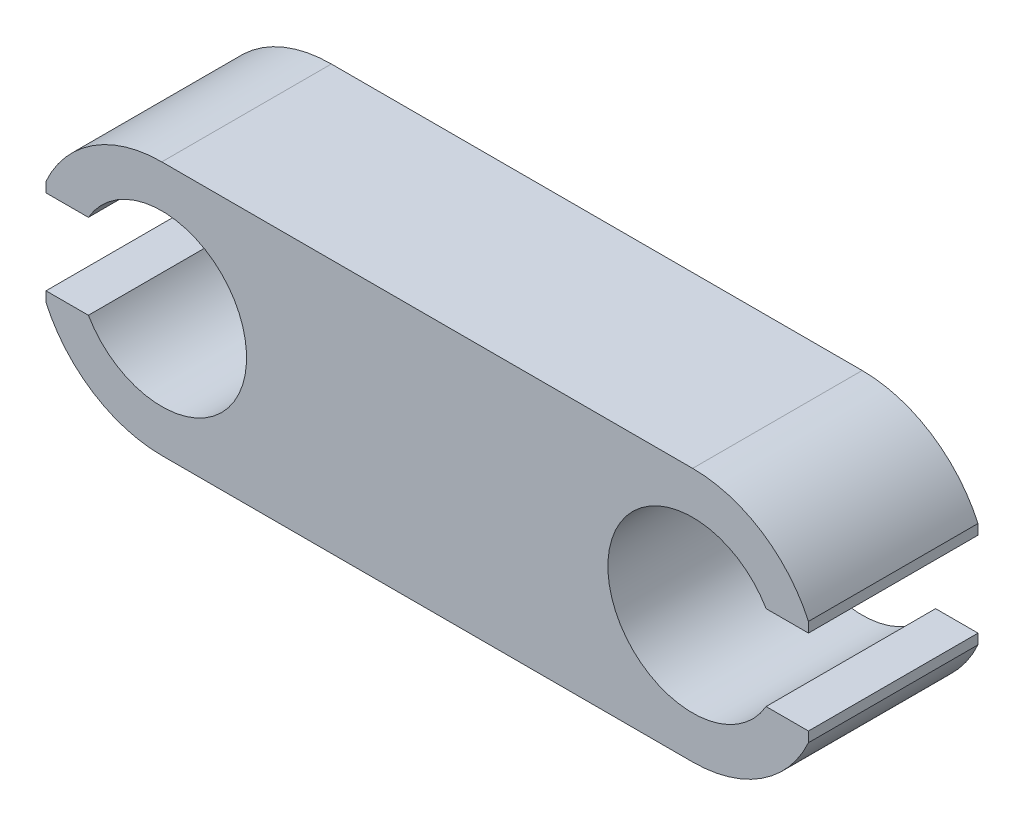
ISO-10303-21;
HEADER;
FILE_DESCRIPTION(('STEP AP214'),'2;1');
FILE_NAME('part.step','',(''),(''),'','','');
FILE_SCHEMA(('AUTOMOTIVE_DESIGN { 1 0 10303 214 1 1 1 1 }'));
ENDSEC;
DATA;
#1=APPLICATION_CONTEXT('core data for automotive mechanical design processes');
#2=APPLICATION_PROTOCOL_DEFINITION('international standard','automotive_design',2000,#1);
#3=PRODUCT_CONTEXT('',#1,'mechanical');
#4=PRODUCT('Part','Part','',(#3));
#5=PRODUCT_RELATED_PRODUCT_CATEGORY('part','',(#4));
#6=PRODUCT_DEFINITION_FORMATION('','',#4);
#7=PRODUCT_DEFINITION_CONTEXT('part definition',#1,'design');
#8=PRODUCT_DEFINITION('design','',#6,#7);
#9=PRODUCT_DEFINITION_SHAPE('','',#8);
#10=(LENGTH_UNIT() NAMED_UNIT(*) SI_UNIT(.MILLI.,.METRE.));
#11=(NAMED_UNIT(*) PLANE_ANGLE_UNIT() SI_UNIT($,.RADIAN.));
#12=(NAMED_UNIT(*) SI_UNIT($,.STERADIAN.) SOLID_ANGLE_UNIT());
#13=UNCERTAINTY_MEASURE_WITH_UNIT(LENGTH_MEASURE(1.E-05),#10,'distance_accuracy_value','');
#14=(GEOMETRIC_REPRESENTATION_CONTEXT(3) GLOBAL_UNCERTAINTY_ASSIGNED_CONTEXT((#13)) GLOBAL_UNIT_ASSIGNED_CONTEXT((#10,
#11,#12)) REPRESENTATION_CONTEXT('',''));
#15=CARTESIAN_POINT('',(0.,0.,0.));
#16=DIRECTION('',(0.,0.,1.));
#17=DIRECTION('',(1.,0.,0.));
#18=AXIS2_PLACEMENT_3D('',#15,#16,#17);
#19=CARTESIAN_POINT('',(-3.13109105,0.,2.));
#20=DIRECTION('',(0.,0.,-1.));
#21=DIRECTION('',(-1.,0.,0.));
#22=AXIS2_PLACEMENT_3D('',#19,#20,#21);
#23=CYLINDRICAL_SURFACE('',#22,1.5);
#24=CARTESIAN_POINT('',(-3.13109105,0.,2.));
#25=DIRECTION('',(0.,0.,1.));
#26=DIRECTION('',(1.,0.,0.));
#27=AXIS2_PLACEMENT_3D('',#24,#25,#26);
#28=CIRCLE('',#27,1.5);
#29=CARTESIAN_POINT('',(-4.49711645378444,-0.619656837463739,2.));
#30=VERTEX_POINT('',#29);
#31=CARTESIAN_POINT('',(-3.13109105,-1.5,2.));
#32=VERTEX_POINT('',#31);
#33=EDGE_CURVE('E218',#30,#32,#28,.T.);
#34=ORIENTED_EDGE('',*,*,#33,.F.);
#35=DIRECTION('',(0.,0.,1.));
#36=VECTOR('',#35,1.);
#37=CARTESIAN_POINT('',(-4.49711645378444,-0.619656837463739,-1.));
#38=LINE('',#37,#36);
#39=CARTESIAN_POINT('',(-4.49711645378444,-0.619656837463739,0.));
#40=VERTEX_POINT('',#39);
#41=EDGE_CURVE('E197',#40,#30,#38,.T.);
#42=ORIENTED_EDGE('',*,*,#41,.F.);
#43=CARTESIAN_POINT('',(-3.13109105,0.,0.));
#44=DIRECTION('',(0.,0.,1.));
#45=DIRECTION('',(1.,0.,0.));
#46=AXIS2_PLACEMENT_3D('',#43,#44,#45);
#47=CIRCLE('',#46,1.5);
#48=CARTESIAN_POINT('',(-3.13109105,-1.5,0.));
#49=VERTEX_POINT('',#48);
#50=EDGE_CURVE('E181',#40,#49,#47,.T.);
#51=ORIENTED_EDGE('',*,*,#50,.T.);
#52=DIRECTION('',(0.,0.,-1.));
#53=VECTOR('',#52,1.);
#54=CARTESIAN_POINT('',(-3.13109105,-1.5,2.));
#55=LINE('',#54,#53);
#56=EDGE_CURVE('E248',#32,#49,#55,.T.);
#57=ORIENTED_EDGE('',*,*,#56,.F.);
#58=EDGE_LOOP('',(#34,#42,#51,#57));
#59=FACE_BOUND('',#58,.T.);
#60=ADVANCED_FACE('F36',(#59),#23,.T.);
#61=CARTESIAN_POINT('',(3.13109105,0.,2.));
#62=DIRECTION('',(0.,0.,-1.));
#63=DIRECTION('',(-1.,0.,0.));
#64=AXIS2_PLACEMENT_3D('',#61,#62,#63);
#65=CYLINDRICAL_SURFACE('',#64,1.5);
#66=DIRECTION('',(0.,0.,1.));
#67=VECTOR('',#66,1.);
#68=CARTESIAN_POINT('',(4.49711645378443,0.619656837463739,-1.));
#69=LINE('',#68,#67);
#70=CARTESIAN_POINT('',(4.49711645378443,0.619656837463739,0.));
#71=VERTEX_POINT('',#70);
#72=CARTESIAN_POINT('',(4.49711645378443,0.619656837463739,2.));
#73=VERTEX_POINT('',#72);
#74=EDGE_CURVE('E184',#71,#73,#69,.T.);
#75=ORIENTED_EDGE('',*,*,#74,.F.);
#76=CARTESIAN_POINT('',(3.13109105,0.,0.));
#77=DIRECTION('',(0.,0.,1.));
#78=DIRECTION('',(1.,0.,0.));
#79=AXIS2_PLACEMENT_3D('',#76,#77,#78);
#80=CIRCLE('',#79,1.5);
#81=CARTESIAN_POINT('',(3.13109105,1.5,0.));
#82=VERTEX_POINT('',#81);
#83=EDGE_CURVE('E236',#82,#71,#80,.F.);
#84=ORIENTED_EDGE('',*,*,#83,.F.);
#85=DIRECTION('',(0.,0.,-1.));
#86=VECTOR('',#85,1.);
#87=CARTESIAN_POINT('',(3.13109105,1.5,2.));
#88=LINE('',#87,#86);
#89=CARTESIAN_POINT('',(3.13109105,1.5,2.));
#90=VERTEX_POINT('',#89);
#91=EDGE_CURVE('E243',#90,#82,#88,.T.);
#92=ORIENTED_EDGE('',*,*,#91,.F.);
#93=CARTESIAN_POINT('',(3.13109105,0.,2.));
#94=DIRECTION('',(0.,0.,1.));
#95=DIRECTION('',(1.,0.,0.));
#96=AXIS2_PLACEMENT_3D('',#93,#94,#95);
#97=CIRCLE('',#96,1.5);
#98=EDGE_CURVE('E222',#90,#73,#97,.F.);
#99=ORIENTED_EDGE('',*,*,#98,.T.);
#100=EDGE_LOOP('',(#75,#84,#92,#99));
#101=FACE_BOUND('',#100,.T.);
#102=ADVANCED_FACE('F283',(#101),#65,.T.);
#103=CARTESIAN_POINT('',(-3.13109105,1.5,0.));
#104=VERTEX_POINT('',#103);
#105=CARTESIAN_POINT('',(-4.49711645378444,0.619656837463739,0.));
#106=VERTEX_POINT('',#105);
#107=EDGE_CURVE('E229',#104,#106,#47,.T.);
#108=ORIENTED_EDGE('',*,*,#107,.T.);
#109=DIRECTION('',(0.,0.,1.));
#110=VECTOR('',#109,1.);
#111=CARTESIAN_POINT('',(-4.49711645378444,0.619656837463739,-1.));
#112=LINE('',#111,#110);
#113=CARTESIAN_POINT('',(-4.49711645378444,0.619656837463739,2.));
#114=VERTEX_POINT('',#113);
#115=EDGE_CURVE('E194',#106,#114,#112,.T.);
#116=ORIENTED_EDGE('',*,*,#115,.T.);
#117=CARTESIAN_POINT('',(-3.13109105,1.5,2.));
#118=VERTEX_POINT('',#117);
#119=EDGE_CURVE('E214',#118,#114,#28,.T.);
#120=ORIENTED_EDGE('',*,*,#119,.F.);
#121=DIRECTION('',(0.,0.,-1.));
#122=VECTOR('',#121,1.);
#123=CARTESIAN_POINT('',(-3.13109105,1.5,2.));
#124=LINE('',#123,#122);
#125=EDGE_CURVE('E228',#118,#104,#124,.T.);
#126=ORIENTED_EDGE('',*,*,#125,.T.);
#127=EDGE_LOOP('',(#108,#116,#120,#126));
#128=FACE_BOUND('',#127,.T.);
#129=ADVANCED_FACE('F38',(#128),#23,.T.);
#130=CARTESIAN_POINT('',(0.,-1.5,2.));
#131=DIRECTION('',(0.,1.,0.));
#132=DIRECTION('',(0.,0.,1.));
#133=AXIS2_PLACEMENT_3D('',#130,#131,#132);
#134=PLANE('',#133);
#135=DIRECTION('',(1.,0.,0.));
#136=VECTOR('',#135,1.);
#137=CARTESIAN_POINT('',(0.,-1.5,0.));
#138=LINE('',#137,#136);
#139=CARTESIAN_POINT('',(3.13109105,-1.5,0.));
#140=VERTEX_POINT('',#139);
#141=EDGE_CURVE('E232',#49,#140,#138,.T.);
#142=ORIENTED_EDGE('',*,*,#141,.T.);
#143=DIRECTION('',(0.,0.,-1.));
#144=VECTOR('',#143,1.);
#145=CARTESIAN_POINT('',(3.13109105,-1.5,2.));
#146=LINE('',#145,#144);
#147=CARTESIAN_POINT('',(3.13109105,-1.5,2.));
#148=VERTEX_POINT('',#147);
#149=EDGE_CURVE('E245',#148,#140,#146,.T.);
#150=ORIENTED_EDGE('',*,*,#149,.F.);
#151=DIRECTION('',(1.,0.,0.));
#152=VECTOR('',#151,1.);
#153=CARTESIAN_POINT('',(0.,-1.5,2.));
#154=LINE('',#153,#152);
#155=EDGE_CURVE('E217',#32,#148,#154,.T.);
#156=ORIENTED_EDGE('',*,*,#155,.F.);
#157=ORIENTED_EDGE('',*,*,#56,.T.);
#158=EDGE_LOOP('',(#142,#150,#156,#157));
#159=FACE_BOUND('',#158,.T.);
#160=ADVANCED_FACE('F318',(#159),#134,.F.);
#161=DIRECTION('',(0.,0.,1.));
#162=VECTOR('',#161,1.);
#163=CARTESIAN_POINT('',(4.49711645378444,-0.619656837463737,-1.));
#164=LINE('',#163,#162);
#165=CARTESIAN_POINT('',(4.49711645378444,-0.619656837463737,0.));
#166=VERTEX_POINT('',#165);
#167=CARTESIAN_POINT('',(4.49711645378444,-0.619656837463737,2.));
#168=VERTEX_POINT('',#167);
#169=EDGE_CURVE('E186',#166,#168,#164,.T.);
#170=ORIENTED_EDGE('',*,*,#169,.T.);
#171=EDGE_CURVE('E221',#168,#148,#97,.F.);
#172=ORIENTED_EDGE('',*,*,#171,.T.);
#173=ORIENTED_EDGE('',*,*,#149,.T.);
#174=EDGE_CURVE('E235',#166,#140,#80,.F.);
#175=ORIENTED_EDGE('',*,*,#174,.F.);
#176=EDGE_LOOP('',(#170,#172,#173,#175));
#177=FACE_BOUND('',#176,.T.);
#178=ADVANCED_FACE('F320',(#177),#65,.T.);
#179=CARTESIAN_POINT('',(0.,1.5,2.));
#180=DIRECTION('',(0.,1.,0.));
#181=DIRECTION('',(0.,0.,1.));
#182=AXIS2_PLACEMENT_3D('',#179,#180,#181);
#183=PLANE('',#182);
#184=DIRECTION('',(1.,0.,0.));
#185=VECTOR('',#184,1.);
#186=CARTESIAN_POINT('',(0.,1.5,0.));
#187=LINE('',#186,#185);
#188=EDGE_CURVE('E239',#104,#82,#187,.T.);
#189=ORIENTED_EDGE('',*,*,#188,.F.);
#190=ORIENTED_EDGE('',*,*,#125,.F.);
#191=DIRECTION('',(1.,0.,0.));
#192=VECTOR('',#191,1.);
#193=CARTESIAN_POINT('',(0.,1.5,2.));
#194=LINE('',#193,#192);
#195=EDGE_CURVE('E225',#118,#90,#194,.T.);
#196=ORIENTED_EDGE('',*,*,#195,.T.);
#197=ORIENTED_EDGE('',*,*,#91,.T.);
#198=EDGE_LOOP('',(#189,#190,#196,#197));
#199=FACE_BOUND('',#198,.T.);
#200=ADVANCED_FACE('F287',(#199),#183,.T.);
#201=CARTESIAN_POINT('',(0.,0.,2.));
#202=DIRECTION('',(0.,0.,1.));
#203=DIRECTION('',(1.,0.,0.));
#204=AXIS2_PLACEMENT_3D('',#201,#202,#203);
#205=PLANE('',#204);
#206=DIRECTION('',(0.,-1.,0.));
#207=VECTOR('',#206,1.);
#208=CARTESIAN_POINT('',(4.49711645378443,0.5,2.));
#209=LINE('',#208,#207);
#210=CARTESIAN_POINT('',(4.49711645378443,0.5,2.));
#211=VERTEX_POINT('',#210);
#212=EDGE_CURVE('E174',#73,#211,#209,.T.);
#213=ORIENTED_EDGE('',*,*,#212,.F.);
#214=ORIENTED_EDGE('',*,*,#98,.F.);
#215=ORIENTED_EDGE('',*,*,#195,.F.);
#216=ORIENTED_EDGE('',*,*,#119,.T.);
#217=DIRECTION('',(0.,1.,0.));
#218=VECTOR('',#217,1.);
#219=CARTESIAN_POINT('',(-4.49711645378444,0.5,2.));
#220=LINE('',#219,#218);
#221=CARTESIAN_POINT('',(-4.49711645378444,0.5,2.));
#222=VERTEX_POINT('',#221);
#223=EDGE_CURVE('E208',#222,#114,#220,.T.);
#224=ORIENTED_EDGE('',*,*,#223,.F.);
#225=DIRECTION('',(-1.,0.,0.));
#226=VECTOR('',#225,1.);
#227=CARTESIAN_POINT('',(-3.99711645378444,0.5,2.));
#228=LINE('',#227,#226);
#229=CARTESIAN_POINT('',(-3.99711645378444,0.5,2.));
#230=VERTEX_POINT('',#229);
#231=EDGE_CURVE('E210',#230,#222,#228,.T.);
#232=ORIENTED_EDGE('',*,*,#231,.F.);
#233=CARTESIAN_POINT('',(-3.13109105,0.,2.));
#234=DIRECTION('',(0.,0.,1.));
#235=DIRECTION('',(1.,0.,0.));
#236=AXIS2_PLACEMENT_3D('',#233,#234,#235);
#237=CIRCLE('',#236,1.);
#238=CARTESIAN_POINT('',(-3.99711645378444,-0.5,2.));
#239=VERTEX_POINT('',#238);
#240=EDGE_CURVE('E167',#239,#230,#237,.T.);
#241=ORIENTED_EDGE('',*,*,#240,.F.);
#242=DIRECTION('',(1.,0.,0.));
#243=VECTOR('',#242,1.);
#244=CARTESIAN_POINT('',(-3.99711645378444,-0.5,2.));
#245=LINE('',#244,#243);
#246=CARTESIAN_POINT('',(-4.49711645378444,-0.5,2.));
#247=VERTEX_POINT('',#246);
#248=EDGE_CURVE('E192',#247,#239,#245,.T.);
#249=ORIENTED_EDGE('',*,*,#248,.F.);
#250=DIRECTION('',(0.,1.,0.));
#251=VECTOR('',#250,1.);
#252=CARTESIAN_POINT('',(-4.49711645378444,-0.5,2.));
#253=LINE('',#252,#251);
#254=EDGE_CURVE('E205',#30,#247,#253,.T.);
#255=ORIENTED_EDGE('',*,*,#254,.F.);
#256=ORIENTED_EDGE('',*,*,#33,.T.);
#257=ORIENTED_EDGE('',*,*,#155,.T.);
#258=ORIENTED_EDGE('',*,*,#171,.F.);
#259=DIRECTION('',(0.,-1.,0.));
#260=VECTOR('',#259,1.);
#261=CARTESIAN_POINT('',(4.49711645378444,-0.5,2.));
#262=LINE('',#261,#260);
#263=CARTESIAN_POINT('',(4.49711645378444,-0.5,2.));
#264=VERTEX_POINT('',#263);
#265=EDGE_CURVE('E172',#264,#168,#262,.T.);
#266=ORIENTED_EDGE('',*,*,#265,.F.);
#267=DIRECTION('',(1.,0.,0.));
#268=VECTOR('',#267,1.);
#269=CARTESIAN_POINT('',(3.99711645378444,-0.5,2.));
#270=LINE('',#269,#268);
#271=CARTESIAN_POINT('',(3.99711645378444,-0.5,2.));
#272=VERTEX_POINT('',#271);
#273=EDGE_CURVE('E151',#272,#264,#270,.T.);
#274=ORIENTED_EDGE('',*,*,#273,.F.);
#275=CARTESIAN_POINT('',(3.13109105,0.,2.));
#276=DIRECTION('',(0.,0.,1.));
#277=DIRECTION('',(-1.,0.,0.));
#278=AXIS2_PLACEMENT_3D('',#275,#276,#277);
#279=CIRCLE('',#278,1.);
#280=CARTESIAN_POINT('',(3.99711645378443,0.5,2.));
#281=VERTEX_POINT('',#280);
#282=EDGE_CURVE('E160',#281,#272,#279,.T.);
#283=ORIENTED_EDGE('',*,*,#282,.F.);
#284=DIRECTION('',(-1.,0.,0.));
#285=VECTOR('',#284,1.);
#286=CARTESIAN_POINT('',(3.99711645378443,0.5,2.));
#287=LINE('',#286,#285);
#288=EDGE_CURVE('E157',#211,#281,#287,.T.);
#289=ORIENTED_EDGE('',*,*,#288,.F.);
#290=EDGE_LOOP('',(#213,#214,#215,#216,#224,#232,#241,#249,#255,#256,#257,#258,#266,#274,#283,#289));
#291=FACE_BOUND('',#290,.T.);
#292=ADVANCED_FACE('F170',(#291),#205,.T.);
#293=CARTESIAN_POINT('',(0.,0.,0.));
#294=DIRECTION('',(0.,0.,1.));
#295=DIRECTION('',(1.,0.,0.));
#296=AXIS2_PLACEMENT_3D('',#293,#294,#295);
#297=PLANE('',#296);
#298=ORIENTED_EDGE('',*,*,#83,.T.);
#299=DIRECTION('',(0.,-1.,0.));
#300=VECTOR('',#299,1.);
#301=CARTESIAN_POINT('',(4.49711645378443,0.,0.));
#302=LINE('',#301,#300);
#303=CARTESIAN_POINT('',(4.49711645378443,0.5,0.));
#304=VERTEX_POINT('',#303);
#305=EDGE_CURVE('E11',#71,#304,#302,.T.);
#306=ORIENTED_EDGE('',*,*,#305,.T.);
#307=DIRECTION('',(-1.,0.,0.));
#308=VECTOR('',#307,1.);
#309=CARTESIAN_POINT('',(0.,0.500000000000001,0.));
#310=LINE('',#309,#308);
#311=CARTESIAN_POINT('',(3.99711645378443,0.5,0.));
#312=VERTEX_POINT('',#311);
#313=EDGE_CURVE('E44',#304,#312,#310,.T.);
#314=ORIENTED_EDGE('',*,*,#313,.T.);
#315=CARTESIAN_POINT('',(3.13109105,0.,0.));
#316=DIRECTION('',(0.,0.,1.));
#317=DIRECTION('',(1.,0.,0.));
#318=AXIS2_PLACEMENT_3D('',#315,#316,#317);
#319=CIRCLE('',#318,1.);
#320=CARTESIAN_POINT('',(3.99711645378444,-0.5,0.));
#321=VERTEX_POINT('',#320);
#322=EDGE_CURVE('E270',#312,#321,#319,.T.);
#323=ORIENTED_EDGE('',*,*,#322,.T.);
#324=DIRECTION('',(1.,0.,0.));
#325=VECTOR('',#324,1.);
#326=CARTESIAN_POINT('',(0.,-0.500000000000001,0.));
#327=LINE('',#326,#325);
#328=CARTESIAN_POINT('',(4.49711645378444,-0.5,0.));
#329=VERTEX_POINT('',#328);
#330=EDGE_CURVE('E154',#321,#329,#327,.T.);
#331=ORIENTED_EDGE('',*,*,#330,.T.);
#332=DIRECTION('',(0.,-1.,0.));
#333=VECTOR('',#332,1.);
#334=CARTESIAN_POINT('',(4.49711645378443,0.,0.));
#335=LINE('',#334,#333);
#336=EDGE_CURVE('E267',#329,#166,#335,.T.);
#337=ORIENTED_EDGE('',*,*,#336,.T.);
#338=ORIENTED_EDGE('',*,*,#174,.T.);
#339=ORIENTED_EDGE('',*,*,#141,.F.);
#340=ORIENTED_EDGE('',*,*,#50,.F.);
#341=DIRECTION('',(0.,1.,0.));
#342=VECTOR('',#341,1.);
#343=CARTESIAN_POINT('',(-4.49711645378444,0.,0.));
#344=LINE('',#343,#342);
#345=CARTESIAN_POINT('',(-4.49711645378444,-0.5,0.));
#346=VERTEX_POINT('',#345);
#347=EDGE_CURVE('E263',#40,#346,#344,.T.);
#348=ORIENTED_EDGE('',*,*,#347,.T.);
#349=DIRECTION('',(1.,0.,0.));
#350=VECTOR('',#349,1.);
#351=CARTESIAN_POINT('',(0.,-0.500000000000001,0.));
#352=LINE('',#351,#350);
#353=CARTESIAN_POINT('',(-3.99711645378444,-0.5,0.));
#354=VERTEX_POINT('',#353);
#355=EDGE_CURVE('E260',#346,#354,#352,.T.);
#356=ORIENTED_EDGE('',*,*,#355,.T.);
#357=CARTESIAN_POINT('',(-3.13109105,0.,0.));
#358=DIRECTION('',(0.,0.,1.));
#359=DIRECTION('',(1.,0.,0.));
#360=AXIS2_PLACEMENT_3D('',#357,#358,#359);
#361=CIRCLE('',#360,1.);
#362=CARTESIAN_POINT('',(-3.99711645378444,0.5,0.));
#363=VERTEX_POINT('',#362);
#364=EDGE_CURVE('E257',#354,#363,#361,.T.);
#365=ORIENTED_EDGE('',*,*,#364,.T.);
#366=DIRECTION('',(-1.,0.,0.));
#367=VECTOR('',#366,1.);
#368=CARTESIAN_POINT('',(0.,0.500000000000001,0.));
#369=LINE('',#368,#367);
#370=CARTESIAN_POINT('',(-4.49711645378444,0.5,0.));
#371=VERTEX_POINT('',#370);
#372=EDGE_CURVE('E251',#363,#371,#369,.T.);
#373=ORIENTED_EDGE('',*,*,#372,.T.);
#374=DIRECTION('',(0.,1.,0.));
#375=VECTOR('',#374,1.);
#376=CARTESIAN_POINT('',(-4.49711645378444,0.,0.));
#377=LINE('',#376,#375);
#378=EDGE_CURVE('E254',#371,#106,#377,.T.);
#379=ORIENTED_EDGE('',*,*,#378,.T.);
#380=ORIENTED_EDGE('',*,*,#107,.F.);
#381=ORIENTED_EDGE('',*,*,#188,.T.);
#382=EDGE_LOOP('',(#298,#306,#314,#323,#331,#337,#338,#339,#340,#348,#356,#365,#373,#379,#380,#381));
#383=FACE_BOUND('',#382,.T.);
#384=ADVANCED_FACE('F273',(#383),#297,.F.);
#385=CARTESIAN_POINT('',(-3.13109105,0.,-1.));
#386=DIRECTION('',(0.,0.,1.));
#387=DIRECTION('',(1.,0.,0.));
#388=AXIS2_PLACEMENT_3D('',#385,#386,#387);
#389=CYLINDRICAL_SURFACE('',#388,1.);
#390=DIRECTION('',(0.,0.,1.));
#391=VECTOR('',#390,1.);
#392=CARTESIAN_POINT('',(-3.99711645378444,-0.5,-1.));
#393=LINE('',#392,#391);
#394=EDGE_CURVE('E201',#354,#239,#393,.T.);
#395=ORIENTED_EDGE('',*,*,#394,.T.);
#396=ORIENTED_EDGE('',*,*,#240,.T.);
#397=DIRECTION('',(0.,0.,1.));
#398=VECTOR('',#397,1.);
#399=CARTESIAN_POINT('',(-3.99711645378444,0.5,-1.));
#400=LINE('',#399,#398);
#401=EDGE_CURVE('E190',#363,#230,#400,.T.);
#402=ORIENTED_EDGE('',*,*,#401,.F.);
#403=ORIENTED_EDGE('',*,*,#364,.F.);
#404=EDGE_LOOP('',(#395,#396,#402,#403));
#405=FACE_BOUND('',#404,.T.);
#406=ADVANCED_FACE('F298',(#405),#389,.F.);
#407=CARTESIAN_POINT('',(-3.99711645378444,-0.5,-1.));
#408=DIRECTION('',(0.,-1.,0.));
#409=DIRECTION('',(1.,0.,0.));
#410=AXIS2_PLACEMENT_3D('',#407,#408,#409);
#411=PLANE('',#410);
#412=DIRECTION('',(0.,0.,1.));
#413=VECTOR('',#412,1.);
#414=CARTESIAN_POINT('',(-4.49711645378444,-0.5,-1.));
#415=LINE('',#414,#413);
#416=EDGE_CURVE('E199',#346,#247,#415,.T.);
#417=ORIENTED_EDGE('',*,*,#416,.T.);
#418=ORIENTED_EDGE('',*,*,#248,.T.);
#419=ORIENTED_EDGE('',*,*,#394,.F.);
#420=ORIENTED_EDGE('',*,*,#355,.F.);
#421=EDGE_LOOP('',(#417,#418,#419,#420));
#422=FACE_BOUND('',#421,.T.);
#423=ADVANCED_FACE('F305',(#422),#411,.F.);
#424=CARTESIAN_POINT('',(-4.49711645378444,-0.5,-1.));
#425=DIRECTION('',(1.,0.,0.));
#426=DIRECTION('',(0.,0.,-1.));
#427=AXIS2_PLACEMENT_3D('',#424,#425,#426);
#428=PLANE('',#427);
#429=ORIENTED_EDGE('',*,*,#41,.T.);
#430=ORIENTED_EDGE('',*,*,#254,.T.);
#431=ORIENTED_EDGE('',*,*,#416,.F.);
#432=ORIENTED_EDGE('',*,*,#347,.F.);
#433=EDGE_LOOP('',(#429,#430,#431,#432));
#434=FACE_BOUND('',#433,.T.);
#435=ADVANCED_FACE('F308',(#434),#428,.F.);
#436=CARTESIAN_POINT('',(-4.49711645378444,0.5,-1.));
#437=DIRECTION('',(1.,0.,0.));
#438=DIRECTION('',(0.,0.,-1.));
#439=AXIS2_PLACEMENT_3D('',#436,#437,#438);
#440=PLANE('',#439);
#441=DIRECTION('',(0.,0.,1.));
#442=VECTOR('',#441,1.);
#443=CARTESIAN_POINT('',(-4.49711645378444,0.5,-1.));
#444=LINE('',#443,#442);
#445=EDGE_CURVE('E59',#371,#222,#444,.T.);
#446=ORIENTED_EDGE('',*,*,#445,.T.);
#447=ORIENTED_EDGE('',*,*,#223,.T.);
#448=ORIENTED_EDGE('',*,*,#115,.F.);
#449=ORIENTED_EDGE('',*,*,#378,.F.);
#450=EDGE_LOOP('',(#446,#447,#448,#449));
#451=FACE_BOUND('',#450,.T.);
#452=ADVANCED_FACE('F294',(#451),#440,.F.);
#453=CARTESIAN_POINT('',(-3.99711645378444,0.5,-1.));
#454=DIRECTION('',(0.,1.,0.));
#455=DIRECTION('',(-1.,0.,0.));
#456=AXIS2_PLACEMENT_3D('',#453,#454,#455);
#457=PLANE('',#456);
#458=ORIENTED_EDGE('',*,*,#401,.T.);
#459=ORIENTED_EDGE('',*,*,#231,.T.);
#460=ORIENTED_EDGE('',*,*,#445,.F.);
#461=ORIENTED_EDGE('',*,*,#372,.F.);
#462=EDGE_LOOP('',(#458,#459,#460,#461));
#463=FACE_BOUND('',#462,.T.);
#464=ADVANCED_FACE('F296',(#463),#457,.F.);
#465=CARTESIAN_POINT('',(3.13109105,0.,-1.));
#466=DIRECTION('',(0.,0.,1.));
#467=DIRECTION('',(1.,0.,0.));
#468=AXIS2_PLACEMENT_3D('',#465,#466,#467);
#469=CYLINDRICAL_SURFACE('',#468,1.);
#470=DIRECTION('',(0.,0.,1.));
#471=VECTOR('',#470,1.);
#472=CARTESIAN_POINT('',(3.99711645378443,0.5,-1.));
#473=LINE('',#472,#471);
#474=EDGE_CURVE('E163',#312,#281,#473,.T.);
#475=ORIENTED_EDGE('',*,*,#474,.T.);
#476=ORIENTED_EDGE('',*,*,#282,.T.);
#477=DIRECTION('',(0.,0.,1.));
#478=VECTOR('',#477,1.);
#479=CARTESIAN_POINT('',(3.99711645378444,-0.5,-1.));
#480=LINE('',#479,#478);
#481=EDGE_CURVE('E147',#321,#272,#480,.T.);
#482=ORIENTED_EDGE('',*,*,#481,.F.);
#483=ORIENTED_EDGE('',*,*,#322,.F.);
#484=EDGE_LOOP('',(#475,#476,#482,#483));
#485=FACE_BOUND('',#484,.T.);
#486=ADVANCED_FACE('F161',(#485),#469,.F.);
#487=CARTESIAN_POINT('',(3.99711645378443,0.5,-1.));
#488=DIRECTION('',(0.,1.,0.));
#489=DIRECTION('',(-1.,0.,0.));
#490=AXIS2_PLACEMENT_3D('',#487,#488,#489);
#491=PLANE('',#490);
#492=DIRECTION('',(0.,0.,1.));
#493=VECTOR('',#492,1.);
#494=CARTESIAN_POINT('',(4.49711645378443,0.5,-1.));
#495=LINE('',#494,#493);
#496=EDGE_CURVE('E182',#304,#211,#495,.T.);
#497=ORIENTED_EDGE('',*,*,#496,.T.);
#498=ORIENTED_EDGE('',*,*,#288,.T.);
#499=ORIENTED_EDGE('',*,*,#474,.F.);
#500=ORIENTED_EDGE('',*,*,#313,.F.);
#501=EDGE_LOOP('',(#497,#498,#499,#500));
#502=FACE_BOUND('',#501,.T.);
#503=ADVANCED_FACE('F276',(#502),#491,.F.);
#504=CARTESIAN_POINT('',(4.49711645378443,0.5,-1.));
#505=DIRECTION('',(-1.,0.,0.));
#506=DIRECTION('',(0.,0.,1.));
#507=AXIS2_PLACEMENT_3D('',#504,#505,#506);
#508=PLANE('',#507);
#509=ORIENTED_EDGE('',*,*,#74,.T.);
#510=ORIENTED_EDGE('',*,*,#212,.T.);
#511=ORIENTED_EDGE('',*,*,#496,.F.);
#512=ORIENTED_EDGE('',*,*,#305,.F.);
#513=EDGE_LOOP('',(#509,#510,#511,#512));
#514=FACE_BOUND('',#513,.T.);
#515=ADVANCED_FACE('F278',(#514),#508,.F.);
#516=CARTESIAN_POINT('',(4.49711645378444,-0.5,-1.));
#517=DIRECTION('',(-1.,0.,0.));
#518=DIRECTION('',(0.,-1.,0.));
#519=AXIS2_PLACEMENT_3D('',#516,#517,#518);
#520=PLANE('',#519);
#521=DIRECTION('',(0.,0.,1.));
#522=VECTOR('',#521,1.);
#523=CARTESIAN_POINT('',(4.49711645378444,-0.5,-1.));
#524=LINE('',#523,#522);
#525=EDGE_CURVE('E51',#329,#264,#524,.T.);
#526=ORIENTED_EDGE('',*,*,#525,.T.);
#527=ORIENTED_EDGE('',*,*,#265,.T.);
#528=ORIENTED_EDGE('',*,*,#169,.F.);
#529=ORIENTED_EDGE('',*,*,#336,.F.);
#530=EDGE_LOOP('',(#526,#527,#528,#529));
#531=FACE_BOUND('',#530,.T.);
#532=ADVANCED_FACE('F322',(#531),#520,.F.);
#533=CARTESIAN_POINT('',(3.99711645378444,-0.5,-1.));
#534=DIRECTION('',(0.,-1.,0.));
#535=DIRECTION('',(1.,0.,0.));
#536=AXIS2_PLACEMENT_3D('',#533,#534,#535);
#537=PLANE('',#536);
#538=ORIENTED_EDGE('',*,*,#481,.T.);
#539=ORIENTED_EDGE('',*,*,#273,.T.);
#540=ORIENTED_EDGE('',*,*,#525,.F.);
#541=ORIENTED_EDGE('',*,*,#330,.F.);
#542=EDGE_LOOP('',(#538,#539,#540,#541));
#543=FACE_BOUND('',#542,.T.);
#544=ADVANCED_FACE('F149',(#543),#537,.F.);
#545=CLOSED_SHELL('',(#60,#102,#129,#160,#178,#200,#292,#384,#406,#423,#435,#452,#464,#486,#503,
#515,#532,#544));
#546=MANIFOLD_SOLID_BREP('B2',#545);
#547=ADVANCED_BREP_SHAPE_REPRESENTATION('',(#18,#546),#14);
#548=SHAPE_DEFINITION_REPRESENTATION(#9,#547);
ENDSEC;
END-ISO-10303-21;
